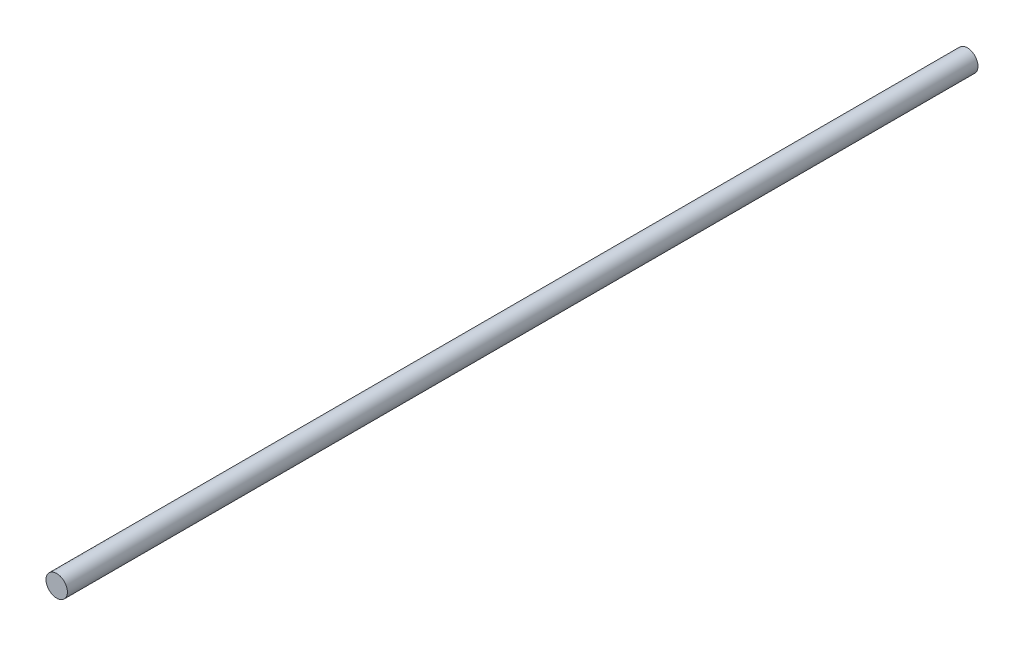
ISO-10303-21;
HEADER;
FILE_DESCRIPTION(('STEP AP214'),'2;1');
FILE_NAME('part.step','',(''),(''),'','','');
FILE_SCHEMA(('AUTOMOTIVE_DESIGN { 1 0 10303 214 1 1 1 1 }'));
ENDSEC;
DATA;
#1=APPLICATION_CONTEXT('core data for automotive mechanical design processes');
#2=APPLICATION_PROTOCOL_DEFINITION('international standard','automotive_design',2000,#1);
#3=PRODUCT_CONTEXT('',#1,'mechanical');
#4=PRODUCT('Part','Part','',(#3));
#5=PRODUCT_RELATED_PRODUCT_CATEGORY('part','',(#4));
#6=PRODUCT_DEFINITION_FORMATION('','',#4);
#7=PRODUCT_DEFINITION_CONTEXT('part definition',#1,'design');
#8=PRODUCT_DEFINITION('design','',#6,#7);
#9=PRODUCT_DEFINITION_SHAPE('','',#8);
#10=(LENGTH_UNIT() NAMED_UNIT(*) SI_UNIT(.MILLI.,.METRE.));
#11=(NAMED_UNIT(*) PLANE_ANGLE_UNIT() SI_UNIT($,.RADIAN.));
#12=(NAMED_UNIT(*) SI_UNIT($,.STERADIAN.) SOLID_ANGLE_UNIT());
#13=UNCERTAINTY_MEASURE_WITH_UNIT(LENGTH_MEASURE(1.E-05),#10,'distance_accuracy_value','');
#14=(GEOMETRIC_REPRESENTATION_CONTEXT(3) GLOBAL_UNCERTAINTY_ASSIGNED_CONTEXT((#13)) GLOBAL_UNIT_ASSIGNED_CONTEXT((#10,
#11,#12)) REPRESENTATION_CONTEXT('',''));
#15=CARTESIAN_POINT('',(0.,0.,0.));
#16=DIRECTION('',(0.,0.,1.));
#17=DIRECTION('',(1.,0.,0.));
#18=AXIS2_PLACEMENT_3D('',#15,#16,#17);
#19=CARTESIAN_POINT('',(0.,0.,85.));
#20=DIRECTION('',(0.,0.,-1.));
#21=DIRECTION('',(-1.,0.,0.));
#22=AXIS2_PLACEMENT_3D('',#19,#20,#21);
#23=CYLINDRICAL_SURFACE('',#22,1.);
#24=CARTESIAN_POINT('',(0.,0.,85.));
#25=DIRECTION('',(0.,0.,1.));
#26=DIRECTION('',(1.,0.,0.));
#27=AXIS2_PLACEMENT_3D('',#24,#25,#26);
#28=CIRCLE('',#27,1.);
#29=CARTESIAN_POINT('',(1.,0.,85.));
#30=VERTEX_POINT('',#29);
#31=EDGE_CURVE('E10',#30,#30,#28,.T.);
#32=ORIENTED_EDGE('',*,*,#31,.F.);
#33=EDGE_LOOP('',(#32));
#34=FACE_BOUND('',#33,.T.);
#35=CARTESIAN_POINT('',(0.,0.,0.));
#36=DIRECTION('',(0.,0.,1.));
#37=DIRECTION('',(1.,0.,0.));
#38=AXIS2_PLACEMENT_3D('',#35,#36,#37);
#39=CIRCLE('',#38,1.);
#40=CARTESIAN_POINT('',(1.,0.,0.));
#41=VERTEX_POINT('',#40);
#42=EDGE_CURVE('E36',#41,#41,#39,.T.);
#43=ORIENTED_EDGE('',*,*,#42,.T.);
#44=EDGE_LOOP('',(#43));
#45=FACE_BOUND('',#44,.T.);
#46=ADVANCED_FACE('F33',(#34,#45),#23,.T.);
#47=CARTESIAN_POINT('',(0.,0.,85.));
#48=DIRECTION('',(0.,0.,1.));
#49=DIRECTION('',(1.,0.,0.));
#50=AXIS2_PLACEMENT_3D('',#47,#48,#49);
#51=PLANE('',#50);
#52=ORIENTED_EDGE('',*,*,#31,.T.);
#53=EDGE_LOOP('',(#52));
#54=FACE_BOUND('',#53,.T.);
#55=ADVANCED_FACE('F48',(#54),#51,.T.);
#56=CARTESIAN_POINT('',(0.,0.,0.));
#57=DIRECTION('',(0.,0.,1.));
#58=DIRECTION('',(1.,0.,0.));
#59=AXIS2_PLACEMENT_3D('',#56,#57,#58);
#60=PLANE('',#59);
#61=ORIENTED_EDGE('',*,*,#42,.F.);
#62=EDGE_LOOP('',(#61));
#63=FACE_BOUND('',#62,.T.);
#64=ADVANCED_FACE('F46',(#63),#60,.F.);
#65=CLOSED_SHELL('',(#46,#55,#64));
#66=MANIFOLD_SOLID_BREP('B2',#65);
#67=ADVANCED_BREP_SHAPE_REPRESENTATION('',(#18,#66),#14);
#68=SHAPE_DEFINITION_REPRESENTATION(#9,#67);
ENDSEC;
END-ISO-10303-21;
